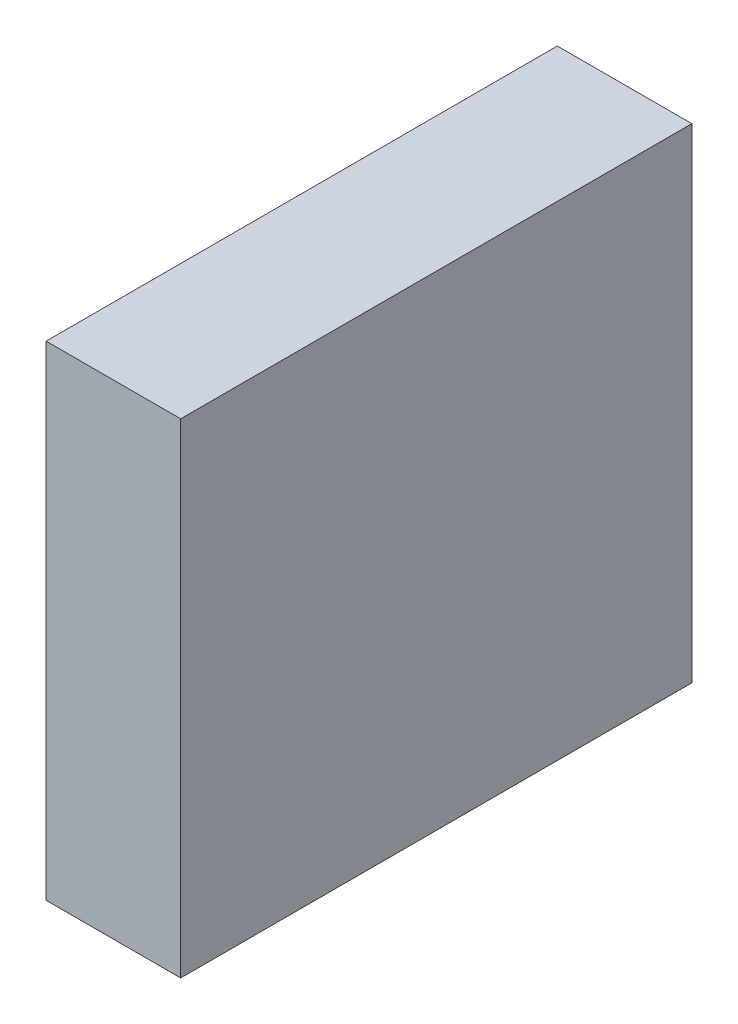
ISO-10303-21;
HEADER;
FILE_DESCRIPTION(('STEP AP214'),'2;1');
FILE_NAME('part.step','',(''),(''),'','','');
FILE_SCHEMA(('AUTOMOTIVE_DESIGN { 1 0 10303 214 1 1 1 1 }'));
ENDSEC;
DATA;
#1=APPLICATION_CONTEXT('core data for automotive mechanical design processes');
#2=APPLICATION_PROTOCOL_DEFINITION('international standard','automotive_design',2000,#1);
#3=PRODUCT_CONTEXT('',#1,'mechanical');
#4=PRODUCT('Part','Part','',(#3));
#5=PRODUCT_RELATED_PRODUCT_CATEGORY('part','',(#4));
#6=PRODUCT_DEFINITION_FORMATION('','',#4);
#7=PRODUCT_DEFINITION_CONTEXT('part definition',#1,'design');
#8=PRODUCT_DEFINITION('design','',#6,#7);
#9=PRODUCT_DEFINITION_SHAPE('','',#8);
#10=(LENGTH_UNIT() NAMED_UNIT(*) SI_UNIT(.MILLI.,.METRE.));
#11=(NAMED_UNIT(*) PLANE_ANGLE_UNIT() SI_UNIT($,.RADIAN.));
#12=(NAMED_UNIT(*) SI_UNIT($,.STERADIAN.) SOLID_ANGLE_UNIT());
#13=UNCERTAINTY_MEASURE_WITH_UNIT(LENGTH_MEASURE(1.E-05),#10,'distance_accuracy_value','');
#14=(GEOMETRIC_REPRESENTATION_CONTEXT(3) GLOBAL_UNCERTAINTY_ASSIGNED_CONTEXT((#13)) GLOBAL_UNIT_ASSIGNED_CONTEXT((#10,
#11,#12)) REPRESENTATION_CONTEXT('',''));
#15=CARTESIAN_POINT('',(0.,0.,0.));
#16=DIRECTION('',(0.,0.,1.));
#17=DIRECTION('',(1.,0.,0.));
#18=AXIS2_PLACEMENT_3D('',#15,#16,#17);
#19=CARTESIAN_POINT('',(-0.2499995,0.90000074,0.));
#20=DIRECTION('',(1.,0.,0.));
#21=DIRECTION('',(0.,-1.,0.));
#22=AXIS2_PLACEMENT_3D('',#19,#20,#21);
#23=PLANE('',#22);
#24=DIRECTION('',(0.,-1.,0.));
#25=VECTOR('',#24,1.);
#26=CARTESIAN_POINT('',(-0.2499995,0.90000074,0.));
#27=LINE('',#26,#25);
#28=CARTESIAN_POINT('',(-0.2499995,0.90000074,0.));
#29=VERTEX_POINT('',#28);
#30=CARTESIAN_POINT('',(-0.2499995,-0.8999982,0.));
#31=VERTEX_POINT('',#30);
#32=EDGE_CURVE('E11',#29,#31,#27,.T.);
#33=ORIENTED_EDGE('',*,*,#32,.T.);
#34=DIRECTION('',(0.,0.,1.));
#35=VECTOR('',#34,1.);
#36=CARTESIAN_POINT('',(-0.2499995,-0.8999982,0.));
#37=LINE('',#36,#35);
#38=CARTESIAN_POINT('',(-0.2499995,-0.8999982,1.89999874));
#39=VERTEX_POINT('',#38);
#40=EDGE_CURVE('E24',#31,#39,#37,.T.);
#41=ORIENTED_EDGE('',*,*,#40,.T.);
#42=DIRECTION('',(0.,-1.,0.));
#43=VECTOR('',#42,1.);
#44=CARTESIAN_POINT('',(-0.2499995,0.90000074,1.89999874));
#45=LINE('',#44,#43);
#46=CARTESIAN_POINT('',(-0.2499995,0.90000074,1.89999874));
#47=VERTEX_POINT('',#46);
#48=EDGE_CURVE('E87',#47,#39,#45,.T.);
#49=ORIENTED_EDGE('',*,*,#48,.F.);
#50=DIRECTION('',(0.,0.,1.));
#51=VECTOR('',#50,1.);
#52=CARTESIAN_POINT('',(-0.2499995,0.90000074,0.));
#53=LINE('',#52,#51);
#54=EDGE_CURVE('E36',#29,#47,#53,.T.);
#55=ORIENTED_EDGE('',*,*,#54,.F.);
#56=EDGE_LOOP('',(#33,#41,#49,#55));
#57=FACE_BOUND('',#56,.T.);
#58=ADVANCED_FACE('F17',(#57),#23,.F.);
#59=CARTESIAN_POINT('',(-0.2499995,-0.8999982,0.));
#60=DIRECTION('',(0.,1.,0.));
#61=DIRECTION('',(1.,0.,0.));
#62=AXIS2_PLACEMENT_3D('',#59,#60,#61);
#63=PLANE('',#62);
#64=DIRECTION('',(1.,0.,0.));
#65=VECTOR('',#64,1.);
#66=CARTESIAN_POINT('',(-0.2499995,-0.8999982,0.));
#67=LINE('',#66,#65);
#68=CARTESIAN_POINT('',(0.2499995,-0.8999982,0.));
#69=VERTEX_POINT('',#68);
#70=EDGE_CURVE('E84',#31,#69,#67,.T.);
#71=ORIENTED_EDGE('',*,*,#70,.T.);
#72=DIRECTION('',(0.,0.,1.));
#73=VECTOR('',#72,1.);
#74=CARTESIAN_POINT('',(0.2499995,-0.8999982,0.));
#75=LINE('',#74,#73);
#76=CARTESIAN_POINT('',(0.2499995,-0.8999982,1.89999874));
#77=VERTEX_POINT('',#76);
#78=EDGE_CURVE('E82',#69,#77,#75,.T.);
#79=ORIENTED_EDGE('',*,*,#78,.T.);
#80=DIRECTION('',(1.,0.,0.));
#81=VECTOR('',#80,1.);
#82=CARTESIAN_POINT('',(-0.2499995,-0.8999982,1.89999874));
#83=LINE('',#82,#81);
#84=EDGE_CURVE('E62',#39,#77,#83,.T.);
#85=ORIENTED_EDGE('',*,*,#84,.F.);
#86=ORIENTED_EDGE('',*,*,#40,.F.);
#87=EDGE_LOOP('',(#71,#79,#85,#86));
#88=FACE_BOUND('',#87,.T.);
#89=ADVANCED_FACE('F89',(#88),#63,.F.);
#90=CARTESIAN_POINT('',(0.2499995,-0.8999982,0.));
#91=DIRECTION('',(-1.,0.,0.));
#92=DIRECTION('',(0.,1.,0.));
#93=AXIS2_PLACEMENT_3D('',#90,#91,#92);
#94=PLANE('',#93);
#95=DIRECTION('',(0.,1.,0.));
#96=VECTOR('',#95,1.);
#97=CARTESIAN_POINT('',(0.2499995,-0.8999982,0.));
#98=LINE('',#97,#96);
#99=CARTESIAN_POINT('',(0.2499995,0.90000074,0.));
#100=VERTEX_POINT('',#99);
#101=EDGE_CURVE('E71',#69,#100,#98,.T.);
#102=ORIENTED_EDGE('',*,*,#101,.T.);
#103=DIRECTION('',(0.,0.,1.));
#104=VECTOR('',#103,1.);
#105=CARTESIAN_POINT('',(0.2499995,0.90000074,0.));
#106=LINE('',#105,#104);
#107=CARTESIAN_POINT('',(0.2499995,0.90000074,1.89999874));
#108=VERTEX_POINT('',#107);
#109=EDGE_CURVE('E65',#100,#108,#106,.T.);
#110=ORIENTED_EDGE('',*,*,#109,.T.);
#111=DIRECTION('',(0.,1.,0.));
#112=VECTOR('',#111,1.);
#113=CARTESIAN_POINT('',(0.2499995,-0.8999982,1.89999874));
#114=LINE('',#113,#112);
#115=EDGE_CURVE('E57',#77,#108,#114,.T.);
#116=ORIENTED_EDGE('',*,*,#115,.F.);
#117=ORIENTED_EDGE('',*,*,#78,.F.);
#118=EDGE_LOOP('',(#102,#110,#116,#117));
#119=FACE_BOUND('',#118,.T.);
#120=ADVANCED_FACE('F69',(#119),#94,.F.);
#121=CARTESIAN_POINT('',(0.2499995,0.90000074,0.));
#122=DIRECTION('',(0.,-1.,0.));
#123=DIRECTION('',(-1.,0.,0.));
#124=AXIS2_PLACEMENT_3D('',#121,#122,#123);
#125=PLANE('',#124);
#126=DIRECTION('',(-1.,0.,0.));
#127=VECTOR('',#126,1.);
#128=CARTESIAN_POINT('',(0.2499995,0.90000074,0.));
#129=LINE('',#128,#127);
#130=EDGE_CURVE('E66',#100,#29,#129,.T.);
#131=ORIENTED_EDGE('',*,*,#130,.T.);
#132=ORIENTED_EDGE('',*,*,#54,.T.);
#133=DIRECTION('',(-1.,0.,0.));
#134=VECTOR('',#133,1.);
#135=CARTESIAN_POINT('',(0.2499995,0.90000074,1.89999874));
#136=LINE('',#135,#134);
#137=EDGE_CURVE('E61',#108,#47,#136,.T.);
#138=ORIENTED_EDGE('',*,*,#137,.F.);
#139=ORIENTED_EDGE('',*,*,#109,.F.);
#140=EDGE_LOOP('',(#131,#132,#138,#139));
#141=FACE_BOUND('',#140,.T.);
#142=ADVANCED_FACE('F76',(#141),#125,.F.);
#143=CARTESIAN_POINT('',(-0.2499995,0.90000074,0.));
#144=DIRECTION('',(0.,0.,-1.));
#145=DIRECTION('',(-1.,0.,0.));
#146=AXIS2_PLACEMENT_3D('',#143,#144,#145);
#147=PLANE('',#146);
#148=ORIENTED_EDGE('',*,*,#130,.F.);
#149=ORIENTED_EDGE('',*,*,#101,.F.);
#150=ORIENTED_EDGE('',*,*,#70,.F.);
#151=ORIENTED_EDGE('',*,*,#32,.F.);
#152=EDGE_LOOP('',(#148,#149,#150,#151));
#153=FACE_BOUND('',#152,.T.);
#154=ADVANCED_FACE('F91',(#153),#147,.T.);
#155=CARTESIAN_POINT('',(-0.2499995,0.90000074,1.89999874));
#156=DIRECTION('',(0.,0.,-1.));
#157=DIRECTION('',(-1.,0.,0.));
#158=AXIS2_PLACEMENT_3D('',#155,#156,#157);
#159=PLANE('',#158);
#160=ORIENTED_EDGE('',*,*,#48,.T.);
#161=ORIENTED_EDGE('',*,*,#84,.T.);
#162=ORIENTED_EDGE('',*,*,#115,.T.);
#163=ORIENTED_EDGE('',*,*,#137,.T.);
#164=EDGE_LOOP('',(#160,#161,#162,#163));
#165=FACE_BOUND('',#164,.T.);
#166=ADVANCED_FACE('F59',(#165),#159,.F.);
#167=CLOSED_SHELL('',(#58,#89,#120,#142,#154,#166));
#168=MANIFOLD_SOLID_BREP('B1',#167);
#169=ADVANCED_BREP_SHAPE_REPRESENTATION('',(#18,#168),#14);
#170=SHAPE_DEFINITION_REPRESENTATION(#9,#169);
ENDSEC;
END-ISO-10303-21;
